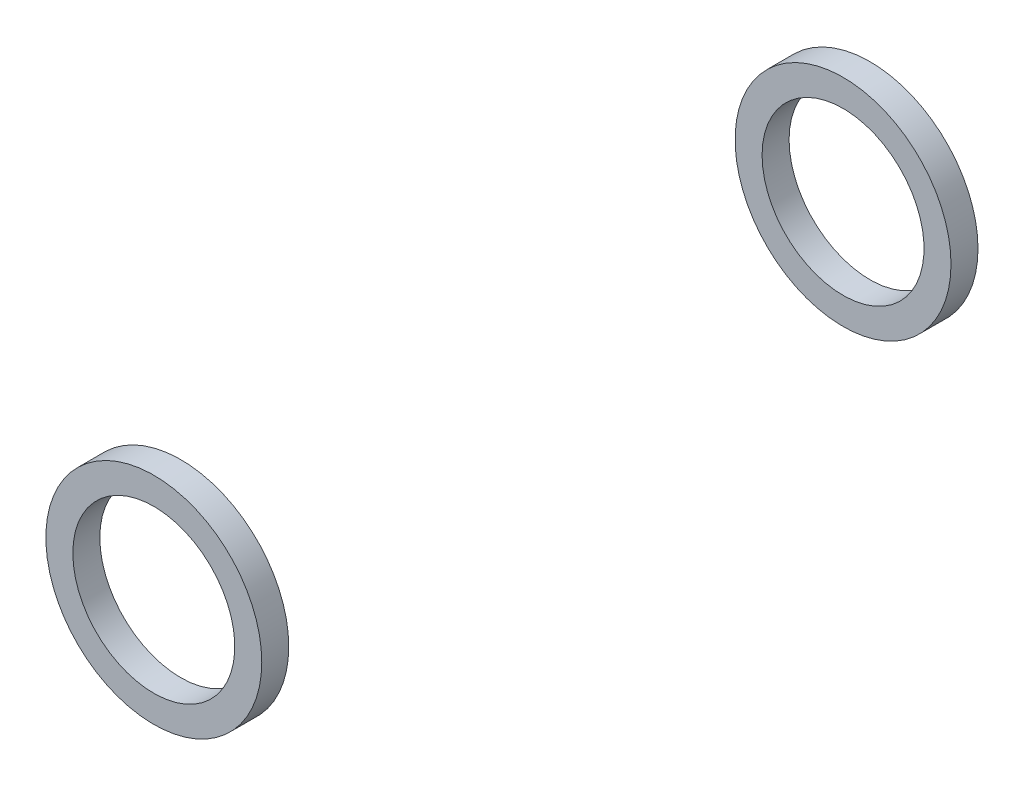
ISO-10303-21;
HEADER;
FILE_DESCRIPTION(('STEP AP214'),'2;1');
FILE_NAME('part.step','',(''),(''),'','','');
FILE_SCHEMA(('AUTOMOTIVE_DESIGN { 1 0 10303 214 1 1 1 1 }'));
ENDSEC;
DATA;
#1=APPLICATION_CONTEXT('core data for automotive mechanical design processes');
#2=APPLICATION_PROTOCOL_DEFINITION('international standard','automotive_design',2000,#1);
#3=PRODUCT_CONTEXT('',#1,'mechanical');
#4=PRODUCT('Part','Part','',(#3));
#5=PRODUCT_RELATED_PRODUCT_CATEGORY('part','',(#4));
#6=PRODUCT_DEFINITION_FORMATION('','',#4);
#7=PRODUCT_DEFINITION_CONTEXT('part definition',#1,'design');
#8=PRODUCT_DEFINITION('design','',#6,#7);
#9=PRODUCT_DEFINITION_SHAPE('','',#8);
#10=(LENGTH_UNIT() NAMED_UNIT(*) SI_UNIT(.MILLI.,.METRE.));
#11=(NAMED_UNIT(*) PLANE_ANGLE_UNIT() SI_UNIT($,.RADIAN.));
#12=(NAMED_UNIT(*) SI_UNIT($,.STERADIAN.) SOLID_ANGLE_UNIT());
#13=UNCERTAINTY_MEASURE_WITH_UNIT(LENGTH_MEASURE(1.E-05),#10,'distance_accuracy_value','');
#14=(GEOMETRIC_REPRESENTATION_CONTEXT(3) GLOBAL_UNCERTAINTY_ASSIGNED_CONTEXT((#13)) GLOBAL_UNIT_ASSIGNED_CONTEXT((#10,
#11,#12)) REPRESENTATION_CONTEXT('',''));
#15=CARTESIAN_POINT('',(0.,0.,0.));
#16=DIRECTION('',(0.,0.,1.));
#17=DIRECTION('',(1.,0.,0.));
#18=AXIS2_PLACEMENT_3D('',#15,#16,#17);
#19=CARTESIAN_POINT('',(0.,0.,66.345));
#20=DIRECTION('',(0.,0.,-1.));
#21=DIRECTION('',(-1.,0.,0.));
#22=AXIS2_PLACEMENT_3D('',#19,#20,#21);
#23=CYLINDRICAL_SURFACE('',#22,20.);
#24=CARTESIAN_POINT('',(0.,0.,66.345));
#25=DIRECTION('',(0.,0.,1.));
#26=DIRECTION('',(1.,0.,0.));
#27=AXIS2_PLACEMENT_3D('',#24,#25,#26);
#28=CIRCLE('',#27,20.);
#29=CARTESIAN_POINT('',(20.,0.,66.345));
#30=VERTEX_POINT('',#29);
#31=EDGE_CURVE('E51',#30,#30,#28,.T.);
#32=ORIENTED_EDGE('',*,*,#31,.F.);
#33=EDGE_LOOP('',(#32));
#34=FACE_BOUND('',#33,.T.);
#35=CARTESIAN_POINT('',(0.,0.,61.345));
#36=DIRECTION('',(0.,0.,1.));
#37=DIRECTION('',(1.,0.,0.));
#38=AXIS2_PLACEMENT_3D('',#35,#36,#37);
#39=CIRCLE('',#38,20.);
#40=CARTESIAN_POINT('',(20.,0.,61.345));
#41=VERTEX_POINT('',#40);
#42=EDGE_CURVE('E57',#41,#41,#39,.T.);
#43=ORIENTED_EDGE('',*,*,#42,.T.);
#44=EDGE_LOOP('',(#43));
#45=FACE_BOUND('',#44,.T.);
#46=ADVANCED_FACE('F43',(#34,#45),#23,.T.);
#47=CARTESIAN_POINT('',(0.,0.,66.345));
#48=DIRECTION('',(0.,0.,1.));
#49=DIRECTION('',(1.,0.,0.));
#50=AXIS2_PLACEMENT_3D('',#47,#48,#49);
#51=PLANE('',#50);
#52=CARTESIAN_POINT('',(0.,0.,66.345));
#53=DIRECTION('',(0.,0.,-1.));
#54=DIRECTION('',(-1.,0.,0.));
#55=AXIS2_PLACEMENT_3D('',#52,#53,#54);
#56=CIRCLE('',#55,15.);
#57=CARTESIAN_POINT('',(-15.,0.,66.345));
#58=VERTEX_POINT('',#57);
#59=EDGE_CURVE('E47',#58,#58,#56,.T.);
#60=ORIENTED_EDGE('',*,*,#59,.T.);
#61=EDGE_LOOP('',(#60));
#62=FACE_BOUND('',#61,.T.);
#63=ORIENTED_EDGE('',*,*,#31,.T.);
#64=EDGE_LOOP('',(#63));
#65=FACE_BOUND('',#64,.T.);
#66=ADVANCED_FACE('F64',(#62,#65),#51,.T.);
#67=CARTESIAN_POINT('',(0.,0.,61.345));
#68=DIRECTION('',(0.,0.,1.));
#69=DIRECTION('',(1.,0.,0.));
#70=AXIS2_PLACEMENT_3D('',#67,#68,#69);
#71=PLANE('',#70);
#72=CARTESIAN_POINT('',(0.,0.,61.345));
#73=DIRECTION('',(0.,0.,1.));
#74=DIRECTION('',(1.,0.,0.));
#75=AXIS2_PLACEMENT_3D('',#72,#73,#74);
#76=CIRCLE('',#75,15.);
#77=CARTESIAN_POINT('',(15.,0.,61.345));
#78=VERTEX_POINT('',#77);
#79=EDGE_CURVE('E11',#78,#78,#76,.T.);
#80=ORIENTED_EDGE('',*,*,#79,.T.);
#81=EDGE_LOOP('',(#80));
#82=FACE_BOUND('',#81,.T.);
#83=ORIENTED_EDGE('',*,*,#42,.F.);
#84=EDGE_LOOP('',(#83));
#85=FACE_BOUND('',#84,.T.);
#86=ADVANCED_FACE('F69',(#82,#85),#71,.F.);
#87=CARTESIAN_POINT('',(0.,0.,66.345));
#88=DIRECTION('',(0.,0.,-1.));
#89=DIRECTION('',(-1.,0.,0.));
#90=AXIS2_PLACEMENT_3D('',#87,#88,#89);
#91=CYLINDRICAL_SURFACE('',#90,15.);
#92=ORIENTED_EDGE('',*,*,#59,.F.);
#93=EDGE_LOOP('',(#92));
#94=FACE_BOUND('',#93,.T.);
#95=ORIENTED_EDGE('',*,*,#79,.F.);
#96=EDGE_LOOP('',(#95));
#97=FACE_BOUND('',#96,.T.);
#98=ADVANCED_FACE('F45',(#94,#97),#91,.F.);
#99=CLOSED_SHELL('',(#46,#66,#86,#98));
#100=MANIFOLD_SOLID_BREP('B2',#99);
#101=CARTESIAN_POINT('',(0.,0.,-66.345));
#102=DIRECTION('',(0.,0.,-1.));
#103=DIRECTION('',(1.,0.,0.));
#104=AXIS2_PLACEMENT_3D('',#101,#102,#103);
#105=PLANE('',#104);
#106=CARTESIAN_POINT('',(0.,0.,-66.345));
#107=DIRECTION('',(0.,0.,-1.));
#108=DIRECTION('',(-1.,0.,0.));
#109=AXIS2_PLACEMENT_3D('',#106,#107,#108);
#110=CIRCLE('',#109,15.);
#111=CARTESIAN_POINT('',(-15.,0.,-66.345));
#112=VERTEX_POINT('',#111);
#113=EDGE_CURVE('E118',#112,#112,#110,.T.);
#114=ORIENTED_EDGE('',*,*,#113,.F.);
#115=EDGE_LOOP('',(#114));
#116=FACE_BOUND('',#115,.T.);
#117=CARTESIAN_POINT('',(0.,0.,-66.345));
#118=DIRECTION('',(0.,0.,1.));
#119=DIRECTION('',(1.,0.,0.));
#120=AXIS2_PLACEMENT_3D('',#117,#118,#119);
#121=CIRCLE('',#120,20.);
#122=CARTESIAN_POINT('',(20.,0.,-66.345));
#123=VERTEX_POINT('',#122);
#124=EDGE_CURVE('E42',#123,#123,#121,.T.);
#125=ORIENTED_EDGE('',*,*,#124,.F.);
#126=EDGE_LOOP('',(#125));
#127=FACE_BOUND('',#126,.T.);
#128=ADVANCED_FACE('F105',(#116,#127),#105,.T.);
#129=CARTESIAN_POINT('',(0.,0.,-66.345));
#130=DIRECTION('',(0.,0.,1.));
#131=DIRECTION('',(-1.,0.,0.));
#132=AXIS2_PLACEMENT_3D('',#129,#130,#131);
#133=CYLINDRICAL_SURFACE('',#132,20.);
#134=ORIENTED_EDGE('',*,*,#124,.T.);
#135=EDGE_LOOP('',(#134));
#136=FACE_BOUND('',#135,.T.);
#137=CARTESIAN_POINT('',(0.,0.,-61.345));
#138=DIRECTION('',(0.,0.,1.));
#139=DIRECTION('',(1.,0.,0.));
#140=AXIS2_PLACEMENT_3D('',#137,#138,#139);
#141=CIRCLE('',#140,20.);
#142=CARTESIAN_POINT('',(20.,0.,-61.345));
#143=VERTEX_POINT('',#142);
#144=EDGE_CURVE('E113',#143,#143,#141,.T.);
#145=ORIENTED_EDGE('',*,*,#144,.F.);
#146=EDGE_LOOP('',(#145));
#147=FACE_BOUND('',#146,.T.);
#148=ADVANCED_FACE('F107',(#136,#147),#133,.T.);
#149=CARTESIAN_POINT('',(0.,0.,-61.345));
#150=DIRECTION('',(0.,0.,-1.));
#151=DIRECTION('',(1.,0.,0.));
#152=AXIS2_PLACEMENT_3D('',#149,#150,#151);
#153=PLANE('',#152);
#154=CARTESIAN_POINT('',(0.,0.,-61.345));
#155=DIRECTION('',(0.,0.,-1.));
#156=DIRECTION('',(-1.,0.,0.));
#157=AXIS2_PLACEMENT_3D('',#154,#155,#156);
#158=CIRCLE('',#157,15.);
#159=CARTESIAN_POINT('',(-15.,0.,-61.345));
#160=VERTEX_POINT('',#159);
#161=EDGE_CURVE('E109',#160,#160,#158,.T.);
#162=ORIENTED_EDGE('',*,*,#161,.T.);
#163=EDGE_LOOP('',(#162));
#164=FACE_BOUND('',#163,.T.);
#165=ORIENTED_EDGE('',*,*,#144,.T.);
#166=EDGE_LOOP('',(#165));
#167=FACE_BOUND('',#166,.T.);
#168=ADVANCED_FACE('F126',(#164,#167),#153,.F.);
#169=CARTESIAN_POINT('',(0.,0.,66.345));
#170=DIRECTION('',(0.,0.,-1.));
#171=DIRECTION('',(-1.,0.,0.));
#172=AXIS2_PLACEMENT_3D('',#169,#170,#171);
#173=CYLINDRICAL_SURFACE('',#172,15.);
#174=ORIENTED_EDGE('',*,*,#113,.T.);
#175=EDGE_LOOP('',(#174));
#176=FACE_BOUND('',#175,.T.);
#177=ORIENTED_EDGE('',*,*,#161,.F.);
#178=EDGE_LOOP('',(#177));
#179=FACE_BOUND('',#178,.T.);
#180=ADVANCED_FACE('F129',(#176,#179),#173,.F.);
#181=CLOSED_SHELL('',(#128,#148,#168,#180));
#182=MANIFOLD_SOLID_BREP('B6',#181);
#183=ADVANCED_BREP_SHAPE_REPRESENTATION('',(#18,#100,#182),#14);
#184=SHAPE_DEFINITION_REPRESENTATION(#9,#183);
ENDSEC;
END-ISO-10303-21;
